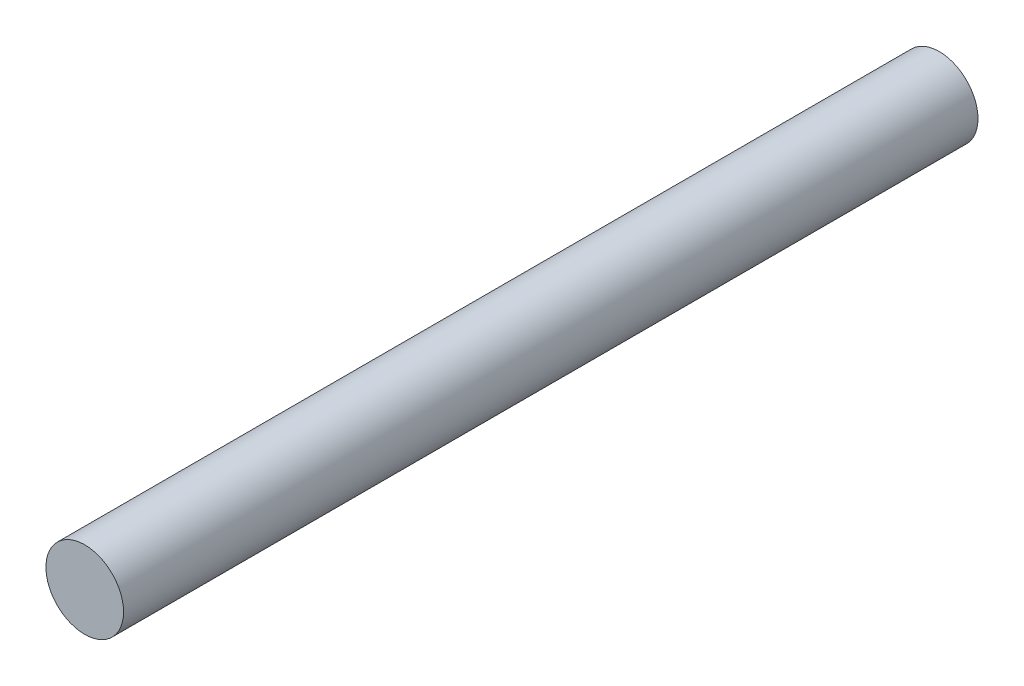
ISO-10303-21;
HEADER;
FILE_DESCRIPTION(('STEP AP214'),'2;1');
FILE_NAME('part.step','',(''),(''),'','','');
FILE_SCHEMA(('AUTOMOTIVE_DESIGN { 1 0 10303 214 1 1 1 1 }'));
ENDSEC;
DATA;
#1=APPLICATION_CONTEXT('core data for automotive mechanical design processes');
#2=APPLICATION_PROTOCOL_DEFINITION('international standard','automotive_design',2000,#1);
#3=PRODUCT_CONTEXT('',#1,'mechanical');
#4=PRODUCT('Part','Part','',(#3));
#5=PRODUCT_RELATED_PRODUCT_CATEGORY('part','',(#4));
#6=PRODUCT_DEFINITION_FORMATION('','',#4);
#7=PRODUCT_DEFINITION_CONTEXT('part definition',#1,'design');
#8=PRODUCT_DEFINITION('design','',#6,#7);
#9=PRODUCT_DEFINITION_SHAPE('','',#8);
#10=(LENGTH_UNIT() NAMED_UNIT(*) SI_UNIT(.MILLI.,.METRE.));
#11=(NAMED_UNIT(*) PLANE_ANGLE_UNIT() SI_UNIT($,.RADIAN.));
#12=(NAMED_UNIT(*) SI_UNIT($,.STERADIAN.) SOLID_ANGLE_UNIT());
#13=UNCERTAINTY_MEASURE_WITH_UNIT(LENGTH_MEASURE(1.E-05),#10,'distance_accuracy_value','');
#14=(GEOMETRIC_REPRESENTATION_CONTEXT(3) GLOBAL_UNCERTAINTY_ASSIGNED_CONTEXT((#13)) GLOBAL_UNIT_ASSIGNED_CONTEXT((#10,
#11,#12)) REPRESENTATION_CONTEXT('',''));
#15=CARTESIAN_POINT('',(0.,0.,0.));
#16=DIRECTION('',(0.,0.,1.));
#17=DIRECTION('',(1.,0.,0.));
#18=AXIS2_PLACEMENT_3D('',#15,#16,#17);
#19=CARTESIAN_POINT('',(0.,0.,350.));
#20=DIRECTION('',(0.,0.,-1.));
#21=DIRECTION('',(-1.,0.,0.));
#22=AXIS2_PLACEMENT_3D('',#19,#20,#21);
#23=CYLINDRICAL_SURFACE('',#22,15.9);
#24=CARTESIAN_POINT('',(0.,0.,350.));
#25=DIRECTION('',(0.,0.,1.));
#26=DIRECTION('',(1.,0.,0.));
#27=AXIS2_PLACEMENT_3D('',#24,#25,#26);
#28=CIRCLE('',#27,15.9);
#29=CARTESIAN_POINT('',(15.9,0.,350.));
#30=VERTEX_POINT('',#29);
#31=EDGE_CURVE('E10',#30,#30,#28,.T.);
#32=ORIENTED_EDGE('',*,*,#31,.F.);
#33=EDGE_LOOP('',(#32));
#34=FACE_BOUND('',#33,.T.);
#35=CARTESIAN_POINT('',(0.,0.,0.));
#36=DIRECTION('',(0.,0.,1.));
#37=DIRECTION('',(1.,0.,0.));
#38=AXIS2_PLACEMENT_3D('',#35,#36,#37);
#39=CIRCLE('',#38,15.9);
#40=CARTESIAN_POINT('',(15.9,0.,0.));
#41=VERTEX_POINT('',#40);
#42=EDGE_CURVE('E32',#41,#41,#39,.T.);
#43=ORIENTED_EDGE('',*,*,#42,.T.);
#44=EDGE_LOOP('',(#43));
#45=FACE_BOUND('',#44,.T.);
#46=ADVANCED_FACE('F29',(#34,#45),#23,.T.);
#47=CARTESIAN_POINT('',(0.,0.,350.));
#48=DIRECTION('',(0.,0.,1.));
#49=DIRECTION('',(1.,0.,0.));
#50=AXIS2_PLACEMENT_3D('',#47,#48,#49);
#51=PLANE('',#50);
#52=ORIENTED_EDGE('',*,*,#31,.T.);
#53=EDGE_LOOP('',(#52));
#54=FACE_BOUND('',#53,.T.);
#55=ADVANCED_FACE('F44',(#54),#51,.T.);
#56=CARTESIAN_POINT('',(0.,0.,0.));
#57=DIRECTION('',(0.,0.,1.));
#58=DIRECTION('',(1.,0.,0.));
#59=AXIS2_PLACEMENT_3D('',#56,#57,#58);
#60=PLANE('',#59);
#61=ORIENTED_EDGE('',*,*,#42,.F.);
#62=EDGE_LOOP('',(#61));
#63=FACE_BOUND('',#62,.T.);
#64=ADVANCED_FACE('F42',(#63),#60,.F.);
#65=CLOSED_SHELL('',(#46,#55,#64));
#66=MANIFOLD_SOLID_BREP('B2',#65);
#67=ADVANCED_BREP_SHAPE_REPRESENTATION('',(#18,#66),#14);
#68=SHAPE_DEFINITION_REPRESENTATION(#9,#67);
ENDSEC;
END-ISO-10303-21;
